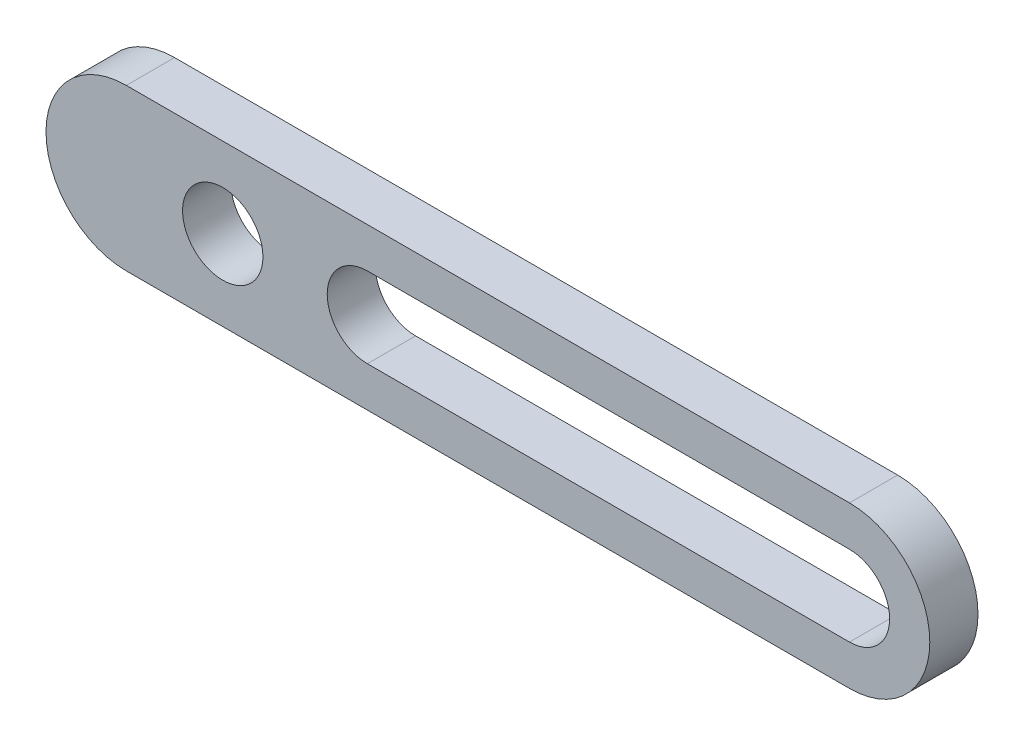
ISO-10303-21;
HEADER;
FILE_DESCRIPTION(('STEP AP214'),'2;1');
FILE_NAME('part.step','',(''),(''),'','','');
FILE_SCHEMA(('AUTOMOTIVE_DESIGN { 1 0 10303 214 1 1 1 1 }'));
ENDSEC;
DATA;
#1=APPLICATION_CONTEXT('core data for automotive mechanical design processes');
#2=APPLICATION_PROTOCOL_DEFINITION('international standard','automotive_design',2000,#1);
#3=PRODUCT_CONTEXT('',#1,'mechanical');
#4=PRODUCT('Part','Part','',(#3));
#5=PRODUCT_RELATED_PRODUCT_CATEGORY('part','',(#4));
#6=PRODUCT_DEFINITION_FORMATION('','',#4);
#7=PRODUCT_DEFINITION_CONTEXT('part definition',#1,'design');
#8=PRODUCT_DEFINITION('design','',#6,#7);
#9=PRODUCT_DEFINITION_SHAPE('','',#8);
#10=(LENGTH_UNIT() NAMED_UNIT(*) SI_UNIT(.MILLI.,.METRE.));
#11=(NAMED_UNIT(*) PLANE_ANGLE_UNIT() SI_UNIT($,.RADIAN.));
#12=(NAMED_UNIT(*) SI_UNIT($,.STERADIAN.) SOLID_ANGLE_UNIT());
#13=UNCERTAINTY_MEASURE_WITH_UNIT(LENGTH_MEASURE(1.E-05),#10,'distance_accuracy_value','');
#14=(GEOMETRIC_REPRESENTATION_CONTEXT(3) GLOBAL_UNCERTAINTY_ASSIGNED_CONTEXT((#13)) GLOBAL_UNIT_ASSIGNED_CONTEXT((#10,
#11,#12)) REPRESENTATION_CONTEXT('',''));
#15=CARTESIAN_POINT('',(0.,0.,0.));
#16=DIRECTION('',(0.,0.,1.));
#17=DIRECTION('',(1.,0.,0.));
#18=AXIS2_PLACEMENT_3D('',#15,#16,#17);
#19=CARTESIAN_POINT('',(0.,5.85565773705982,3.));
#20=DIRECTION('',(0.,1.,0.));
#21=DIRECTION('',(-1.,0.,0.));
#22=AXIS2_PLACEMENT_3D('',#19,#20,#21);
#23=PLANE('',#22);
#24=DIRECTION('',(1.,0.,0.));
#25=VECTOR('',#24,1.);
#26=CARTESIAN_POINT('',(0.,5.85565773705982,0.));
#27=LINE('',#26,#25);
#28=CARTESIAN_POINT('',(2.15249472098786,5.85565773705982,0.));
#29=VERTEX_POINT('',#28);
#30=CARTESIAN_POINT('',(47.1524947209879,5.85565773705982,0.));
#31=VERTEX_POINT('',#30);
#32=EDGE_CURVE('E149',#29,#31,#27,.T.);
#33=ORIENTED_EDGE('',*,*,#32,.F.);
#34=DIRECTION('',(0.,0.,-1.));
#35=VECTOR('',#34,1.);
#36=CARTESIAN_POINT('',(2.15249472098786,5.85565773705982,3.));
#37=LINE('',#36,#35);
#38=CARTESIAN_POINT('',(2.15249472098786,5.85565773705982,3.));
#39=VERTEX_POINT('',#38);
#40=EDGE_CURVE('E11',#39,#29,#37,.T.);
#41=ORIENTED_EDGE('',*,*,#40,.F.);
#42=DIRECTION('',(1.,0.,0.));
#43=VECTOR('',#42,1.);
#44=CARTESIAN_POINT('',(0.,5.85565773705982,3.));
#45=LINE('',#44,#43);
#46=CARTESIAN_POINT('',(47.1524947209879,5.85565773705982,3.));
#47=VERTEX_POINT('',#46);
#48=EDGE_CURVE('E122',#39,#47,#45,.T.);
#49=ORIENTED_EDGE('',*,*,#48,.T.);
#50=DIRECTION('',(0.,0.,-1.));
#51=VECTOR('',#50,1.);
#52=CARTESIAN_POINT('',(47.1524947209879,5.85565773705982,3.));
#53=LINE('',#52,#51);
#54=EDGE_CURVE('E88',#47,#31,#53,.T.);
#55=ORIENTED_EDGE('',*,*,#54,.T.);
#56=EDGE_LOOP('',(#33,#41,#49,#55));
#57=FACE_BOUND('',#56,.T.);
#58=ADVANCED_FACE('F35',(#57),#23,.T.);
#59=CARTESIAN_POINT('',(2.15249472098786,0.855657737059818,3.));
#60=DIRECTION('',(0.,0.,-1.));
#61=DIRECTION('',(-1.,0.,0.));
#62=AXIS2_PLACEMENT_3D('',#59,#60,#61);
#63=CYLINDRICAL_SURFACE('',#62,5.);
#64=CARTESIAN_POINT('',(2.15249472098786,0.855657737059818,0.));
#65=DIRECTION('',(0.,0.,1.));
#66=DIRECTION('',(1.,0.,0.));
#67=AXIS2_PLACEMENT_3D('',#64,#65,#66);
#68=CIRCLE('',#67,5.);
#69=CARTESIAN_POINT('',(2.15249472098786,-4.14434226294018,0.));
#70=VERTEX_POINT('',#69);
#71=EDGE_CURVE('E127',#29,#70,#68,.T.);
#72=ORIENTED_EDGE('',*,*,#71,.T.);
#73=DIRECTION('',(0.,0.,-1.));
#74=VECTOR('',#73,1.);
#75=CARTESIAN_POINT('',(2.15249472098786,-4.14434226294018,3.));
#76=LINE('',#75,#74);
#77=CARTESIAN_POINT('',(2.15249472098786,-4.14434226294018,3.));
#78=VERTEX_POINT('',#77);
#79=EDGE_CURVE('E45',#78,#70,#76,.T.);
#80=ORIENTED_EDGE('',*,*,#79,.F.);
#81=CARTESIAN_POINT('',(2.15249472098786,0.855657737059818,3.));
#82=DIRECTION('',(0.,0.,1.));
#83=DIRECTION('',(1.,0.,0.));
#84=AXIS2_PLACEMENT_3D('',#81,#82,#83);
#85=CIRCLE('',#84,5.);
#86=EDGE_CURVE('E118',#39,#78,#85,.T.);
#87=ORIENTED_EDGE('',*,*,#86,.F.);
#88=ORIENTED_EDGE('',*,*,#40,.T.);
#89=EDGE_LOOP('',(#72,#80,#87,#88));
#90=FACE_BOUND('',#89,.T.);
#91=ADVANCED_FACE('F125',(#90),#63,.T.);
#92=CARTESIAN_POINT('',(0.,-4.14434226294018,3.));
#93=DIRECTION('',(0.,1.,0.));
#94=DIRECTION('',(-1.,0.,0.));
#95=AXIS2_PLACEMENT_3D('',#92,#93,#94);
#96=PLANE('',#95);
#97=DIRECTION('',(1.,0.,0.));
#98=VECTOR('',#97,1.);
#99=CARTESIAN_POINT('',(0.,-4.14434226294018,0.));
#100=LINE('',#99,#98);
#101=CARTESIAN_POINT('',(47.1524947209879,-4.14434226294018,0.));
#102=VERTEX_POINT('',#101);
#103=EDGE_CURVE('E146',#70,#102,#100,.T.);
#104=ORIENTED_EDGE('',*,*,#103,.T.);
#105=DIRECTION('',(0.,0.,-1.));
#106=VECTOR('',#105,1.);
#107=CARTESIAN_POINT('',(47.1524947209879,-4.14434226294018,3.));
#108=LINE('',#107,#106);
#109=CARTESIAN_POINT('',(47.1524947209879,-4.14434226294018,3.));
#110=VERTEX_POINT('',#109);
#111=EDGE_CURVE('E117',#110,#102,#108,.T.);
#112=ORIENTED_EDGE('',*,*,#111,.F.);
#113=DIRECTION('',(1.,0.,0.));
#114=VECTOR('',#113,1.);
#115=CARTESIAN_POINT('',(0.,-4.14434226294018,3.));
#116=LINE('',#115,#114);
#117=EDGE_CURVE('E111',#78,#110,#116,.T.);
#118=ORIENTED_EDGE('',*,*,#117,.F.);
#119=ORIENTED_EDGE('',*,*,#79,.T.);
#120=EDGE_LOOP('',(#104,#112,#118,#119));
#121=FACE_BOUND('',#120,.T.);
#122=ADVANCED_FACE('F114',(#121),#96,.F.);
#123=CARTESIAN_POINT('',(17.1524947209879,0.855657737059817,3.));
#124=DIRECTION('',(0.,0.,-1.));
#125=DIRECTION('',(-1.,0.,0.));
#126=AXIS2_PLACEMENT_3D('',#123,#124,#125);
#127=CYLINDRICAL_SURFACE('',#126,2.5);
#128=CARTESIAN_POINT('',(17.1524947209879,0.855657737059817,0.));
#129=DIRECTION('',(0.,0.,1.));
#130=DIRECTION('',(1.,0.,0.));
#131=AXIS2_PLACEMENT_3D('',#128,#129,#130);
#132=CIRCLE('',#131,2.5);
#133=CARTESIAN_POINT('',(17.1524947209879,3.35565773705982,0.));
#134=VERTEX_POINT('',#133);
#135=CARTESIAN_POINT('',(17.1524947209879,-1.64434226294018,0.));
#136=VERTEX_POINT('',#135);
#137=EDGE_CURVE('E162',#134,#136,#132,.T.);
#138=ORIENTED_EDGE('',*,*,#137,.F.);
#139=DIRECTION('',(0.,0.,-1.));
#140=VECTOR('',#139,1.);
#141=CARTESIAN_POINT('',(17.1524947209879,3.35565773705982,3.));
#142=LINE('',#141,#140);
#143=CARTESIAN_POINT('',(17.1524947209879,3.35565773705982,3.));
#144=VERTEX_POINT('',#143);
#145=EDGE_CURVE('E39',#144,#134,#142,.T.);
#146=ORIENTED_EDGE('',*,*,#145,.F.);
#147=CARTESIAN_POINT('',(17.1524947209879,0.855657737059817,3.));
#148=DIRECTION('',(0.,0.,1.));
#149=DIRECTION('',(1.,0.,0.));
#150=AXIS2_PLACEMENT_3D('',#147,#148,#149);
#151=CIRCLE('',#150,2.5);
#152=CARTESIAN_POINT('',(17.1524947209879,-1.64434226294018,3.));
#153=VERTEX_POINT('',#152);
#154=EDGE_CURVE('E145',#144,#153,#151,.T.);
#155=ORIENTED_EDGE('',*,*,#154,.T.);
#156=DIRECTION('',(0.,0.,-1.));
#157=VECTOR('',#156,1.);
#158=CARTESIAN_POINT('',(17.1524947209879,-1.64434226294018,3.));
#159=LINE('',#158,#157);
#160=EDGE_CURVE('E132',#153,#136,#159,.T.);
#161=ORIENTED_EDGE('',*,*,#160,.T.);
#162=EDGE_LOOP('',(#138,#146,#155,#161));
#163=FACE_BOUND('',#162,.T.);
#164=ADVANCED_FACE('F37',(#163),#127,.F.);
#165=CARTESIAN_POINT('',(0.,3.35565773705982,3.));
#166=DIRECTION('',(0.,1.,0.));
#167=DIRECTION('',(-1.,0.,0.));
#168=AXIS2_PLACEMENT_3D('',#165,#166,#167);
#169=PLANE('',#168);
#170=DIRECTION('',(1.,0.,0.));
#171=VECTOR('',#170,1.);
#172=CARTESIAN_POINT('',(0.,3.35565773705982,0.));
#173=LINE('',#172,#171);
#174=CARTESIAN_POINT('',(47.1524947209879,3.35565773705982,0.));
#175=VERTEX_POINT('',#174);
#176=EDGE_CURVE('E160',#134,#175,#173,.T.);
#177=ORIENTED_EDGE('',*,*,#176,.T.);
#178=DIRECTION('',(0.,0.,-1.));
#179=VECTOR('',#178,1.);
#180=CARTESIAN_POINT('',(47.1524947209879,3.35565773705982,3.));
#181=LINE('',#180,#179);
#182=CARTESIAN_POINT('',(47.1524947209879,3.35565773705982,3.));
#183=VERTEX_POINT('',#182);
#184=EDGE_CURVE('E135',#183,#175,#181,.T.);
#185=ORIENTED_EDGE('',*,*,#184,.F.);
#186=DIRECTION('',(1.,0.,0.));
#187=VECTOR('',#186,1.);
#188=CARTESIAN_POINT('',(0.,3.35565773705982,3.));
#189=LINE('',#188,#187);
#190=EDGE_CURVE('E175',#144,#183,#189,.T.);
#191=ORIENTED_EDGE('',*,*,#190,.F.);
#192=ORIENTED_EDGE('',*,*,#145,.T.);
#193=EDGE_LOOP('',(#177,#185,#191,#192));
#194=FACE_BOUND('',#193,.T.);
#195=ADVANCED_FACE('F188',(#194),#169,.F.);
#196=CARTESIAN_POINT('',(47.1524947209879,0.855657737059817,3.));
#197=DIRECTION('',(0.,0.,-1.));
#198=DIRECTION('',(-1.,0.,0.));
#199=AXIS2_PLACEMENT_3D('',#196,#197,#198);
#200=CYLINDRICAL_SURFACE('',#199,2.5);
#201=CARTESIAN_POINT('',(47.1524947209879,0.855657737059817,0.));
#202=DIRECTION('',(0.,0.,1.));
#203=DIRECTION('',(1.,0.,0.));
#204=AXIS2_PLACEMENT_3D('',#201,#202,#203);
#205=CIRCLE('',#204,2.5);
#206=CARTESIAN_POINT('',(47.1524947209879,-1.64434226294018,0.));
#207=VERTEX_POINT('',#206);
#208=EDGE_CURVE('E157',#207,#175,#205,.T.);
#209=ORIENTED_EDGE('',*,*,#208,.F.);
#210=DIRECTION('',(0.,0.,-1.));
#211=VECTOR('',#210,1.);
#212=CARTESIAN_POINT('',(47.1524947209879,-1.64434226294018,3.));
#213=LINE('',#212,#211);
#214=CARTESIAN_POINT('',(47.1524947209879,-1.64434226294018,3.));
#215=VERTEX_POINT('',#214);
#216=EDGE_CURVE('E134',#215,#207,#213,.T.);
#217=ORIENTED_EDGE('',*,*,#216,.F.);
#218=CARTESIAN_POINT('',(47.1524947209879,0.855657737059817,3.));
#219=DIRECTION('',(0.,0.,1.));
#220=DIRECTION('',(1.,0.,0.));
#221=AXIS2_PLACEMENT_3D('',#218,#219,#220);
#222=CIRCLE('',#221,2.5);
#223=EDGE_CURVE('E173',#215,#183,#222,.T.);
#224=ORIENTED_EDGE('',*,*,#223,.T.);
#225=ORIENTED_EDGE('',*,*,#184,.T.);
#226=EDGE_LOOP('',(#209,#217,#224,#225));
#227=FACE_BOUND('',#226,.T.);
#228=ADVANCED_FACE('F189',(#227),#200,.F.);
#229=CARTESIAN_POINT('',(8.15249472098786,0.855657737059817,3.));
#230=DIRECTION('',(0.,0.,-1.));
#231=DIRECTION('',(-1.,0.,0.));
#232=AXIS2_PLACEMENT_3D('',#229,#230,#231);
#233=CYLINDRICAL_SURFACE('',#232,2.5);
#234=CARTESIAN_POINT('',(8.15249472098786,0.855657737059817,3.));
#235=DIRECTION('',(0.,0.,1.));
#236=DIRECTION('',(1.,0.,0.));
#237=AXIS2_PLACEMENT_3D('',#234,#235,#236);
#238=CIRCLE('',#237,2.5);
#239=CARTESIAN_POINT('',(10.6524947209879,0.855657737059817,3.));
#240=VERTEX_POINT('',#239);
#241=EDGE_CURVE('E167',#240,#240,#238,.T.);
#242=ORIENTED_EDGE('',*,*,#241,.T.);
#243=EDGE_LOOP('',(#242));
#244=FACE_BOUND('',#243,.T.);
#245=CARTESIAN_POINT('',(8.15249472098786,0.855657737059817,0.));
#246=DIRECTION('',(0.,0.,1.));
#247=DIRECTION('',(1.,0.,0.));
#248=AXIS2_PLACEMENT_3D('',#245,#246,#247);
#249=CIRCLE('',#248,2.5);
#250=CARTESIAN_POINT('',(10.6524947209879,0.855657737059817,0.));
#251=VERTEX_POINT('',#250);
#252=EDGE_CURVE('E151',#251,#251,#249,.T.);
#253=ORIENTED_EDGE('',*,*,#252,.F.);
#254=EDGE_LOOP('',(#253));
#255=FACE_BOUND('',#254,.T.);
#256=ADVANCED_FACE('F191',(#244,#255),#233,.F.);
#257=CARTESIAN_POINT('',(0.,-1.64434226294018,3.));
#258=DIRECTION('',(0.,1.,0.));
#259=DIRECTION('',(-1.,0.,0.));
#260=AXIS2_PLACEMENT_3D('',#257,#258,#259);
#261=PLANE('',#260);
#262=DIRECTION('',(1.,0.,0.));
#263=VECTOR('',#262,1.);
#264=CARTESIAN_POINT('',(0.,-1.64434226294018,0.));
#265=LINE('',#264,#263);
#266=EDGE_CURVE('E154',#136,#207,#265,.T.);
#267=ORIENTED_EDGE('',*,*,#266,.F.);
#268=ORIENTED_EDGE('',*,*,#160,.F.);
#269=DIRECTION('',(1.,0.,0.));
#270=VECTOR('',#269,1.);
#271=CARTESIAN_POINT('',(0.,-1.64434226294018,3.));
#272=LINE('',#271,#270);
#273=EDGE_CURVE('E170',#153,#215,#272,.T.);
#274=ORIENTED_EDGE('',*,*,#273,.T.);
#275=ORIENTED_EDGE('',*,*,#216,.T.);
#276=EDGE_LOOP('',(#267,#268,#274,#275));
#277=FACE_BOUND('',#276,.T.);
#278=ADVANCED_FACE('F184',(#277),#261,.T.);
#279=CARTESIAN_POINT('',(47.1524947209879,0.855657737059817,3.));
#280=DIRECTION('',(0.,0.,-1.));
#281=DIRECTION('',(-1.,0.,0.));
#282=AXIS2_PLACEMENT_3D('',#279,#280,#281);
#283=CYLINDRICAL_SURFACE('',#282,5.);
#284=CARTESIAN_POINT('',(47.1524947209879,0.855657737059817,0.));
#285=DIRECTION('',(0.,0.,1.));
#286=DIRECTION('',(1.,0.,0.));
#287=AXIS2_PLACEMENT_3D('',#284,#285,#286);
#288=CIRCLE('',#287,5.);
#289=EDGE_CURVE('E81',#102,#31,#288,.T.);
#290=ORIENTED_EDGE('',*,*,#289,.T.);
#291=ORIENTED_EDGE('',*,*,#54,.F.);
#292=CARTESIAN_POINT('',(47.1524947209879,0.855657737059817,3.));
#293=DIRECTION('',(0.,0.,1.));
#294=DIRECTION('',(1.,0.,0.));
#295=AXIS2_PLACEMENT_3D('',#292,#293,#294);
#296=CIRCLE('',#295,5.);
#297=EDGE_CURVE('E54',#110,#47,#296,.T.);
#298=ORIENTED_EDGE('',*,*,#297,.F.);
#299=ORIENTED_EDGE('',*,*,#111,.T.);
#300=EDGE_LOOP('',(#290,#291,#298,#299));
#301=FACE_BOUND('',#300,.T.);
#302=ADVANCED_FACE('F208',(#301),#283,.T.);
#303=CARTESIAN_POINT('',(0.,0.,3.));
#304=DIRECTION('',(0.,0.,1.));
#305=DIRECTION('',(1.,0.,0.));
#306=AXIS2_PLACEMENT_3D('',#303,#304,#305);
#307=PLANE('',#306);
#308=ORIENTED_EDGE('',*,*,#154,.F.);
#309=ORIENTED_EDGE('',*,*,#190,.T.);
#310=ORIENTED_EDGE('',*,*,#223,.F.);
#311=ORIENTED_EDGE('',*,*,#273,.F.);
#312=EDGE_LOOP('',(#308,#309,#310,#311));
#313=FACE_BOUND('',#312,.T.);
#314=ORIENTED_EDGE('',*,*,#241,.F.);
#315=EDGE_LOOP('',(#314));
#316=FACE_BOUND('',#315,.T.);
#317=ORIENTED_EDGE('',*,*,#48,.F.);
#318=ORIENTED_EDGE('',*,*,#86,.T.);
#319=ORIENTED_EDGE('',*,*,#117,.T.);
#320=ORIENTED_EDGE('',*,*,#297,.T.);
#321=EDGE_LOOP('',(#317,#318,#319,#320));
#322=FACE_BOUND('',#321,.T.);
#323=ADVANCED_FACE('F121',(#313,#316,#322),#307,.T.);
#324=CARTESIAN_POINT('',(0.,0.,0.));
#325=DIRECTION('',(0.,0.,1.));
#326=DIRECTION('',(1.,0.,0.));
#327=AXIS2_PLACEMENT_3D('',#324,#325,#326);
#328=PLANE('',#327);
#329=ORIENTED_EDGE('',*,*,#137,.T.);
#330=ORIENTED_EDGE('',*,*,#266,.T.);
#331=ORIENTED_EDGE('',*,*,#208,.T.);
#332=ORIENTED_EDGE('',*,*,#176,.F.);
#333=EDGE_LOOP('',(#329,#330,#331,#332));
#334=FACE_BOUND('',#333,.T.);
#335=ORIENTED_EDGE('',*,*,#252,.T.);
#336=EDGE_LOOP('',(#335));
#337=FACE_BOUND('',#336,.T.);
#338=ORIENTED_EDGE('',*,*,#32,.T.);
#339=ORIENTED_EDGE('',*,*,#289,.F.);
#340=ORIENTED_EDGE('',*,*,#103,.F.);
#341=ORIENTED_EDGE('',*,*,#71,.F.);
#342=EDGE_LOOP('',(#338,#339,#340,#341));
#343=FACE_BOUND('',#342,.T.);
#344=ADVANCED_FACE('F186',(#334,#337,#343),#328,.F.);
#345=CLOSED_SHELL('',(#58,#91,#122,#164,#195,#228,#256,#278,#302,#323,#344));
#346=MANIFOLD_SOLID_BREP('B2',#345);
#347=ADVANCED_BREP_SHAPE_REPRESENTATION('',(#18,#346),#14);
#348=SHAPE_DEFINITION_REPRESENTATION(#9,#347);
ENDSEC;
END-ISO-10303-21;
